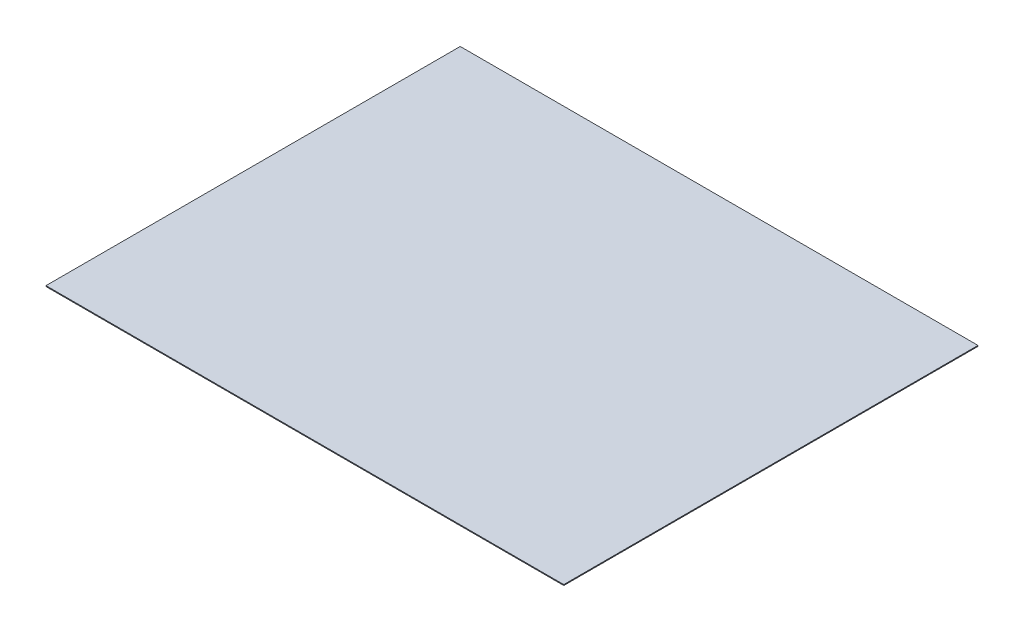
ISO-10303-21;
HEADER;
FILE_DESCRIPTION(('STEP AP214'),'2;1');
FILE_NAME('part.step','',(''),(''),'','','');
FILE_SCHEMA(('AUTOMOTIVE_DESIGN { 1 0 10303 214 1 1 1 1 }'));
ENDSEC;
DATA;
#1=APPLICATION_CONTEXT('core data for automotive mechanical design processes');
#2=APPLICATION_PROTOCOL_DEFINITION('international standard','automotive_design',2000,#1);
#3=PRODUCT_CONTEXT('',#1,'mechanical');
#4=PRODUCT('Part','Part','',(#3));
#5=PRODUCT_RELATED_PRODUCT_CATEGORY('part','',(#4));
#6=PRODUCT_DEFINITION_FORMATION('','',#4);
#7=PRODUCT_DEFINITION_CONTEXT('part definition',#1,'design');
#8=PRODUCT_DEFINITION('design','',#6,#7);
#9=PRODUCT_DEFINITION_SHAPE('','',#8);
#10=(LENGTH_UNIT() NAMED_UNIT(*) SI_UNIT(.MILLI.,.METRE.));
#11=(NAMED_UNIT(*) PLANE_ANGLE_UNIT() SI_UNIT($,.RADIAN.));
#12=(NAMED_UNIT(*) SI_UNIT($,.STERADIAN.) SOLID_ANGLE_UNIT());
#13=UNCERTAINTY_MEASURE_WITH_UNIT(LENGTH_MEASURE(1.E-05),#10,'distance_accuracy_value','');
#14=(GEOMETRIC_REPRESENTATION_CONTEXT(3) GLOBAL_UNCERTAINTY_ASSIGNED_CONTEXT((#13)) GLOBAL_UNIT_ASSIGNED_CONTEXT((#10,
#11,#12)) REPRESENTATION_CONTEXT('',''));
#15=CARTESIAN_POINT('',(0.,0.,0.));
#16=DIRECTION('',(0.,0.,1.));
#17=DIRECTION('',(1.,0.,0.));
#18=AXIS2_PLACEMENT_3D('',#15,#16,#17);
#19=CARTESIAN_POINT('',(-593.124324324324,2.54,-197.708108108108));
#20=DIRECTION('',(1.,0.,0.));
#21=DIRECTION('',(0.,0.,-1.));
#22=AXIS2_PLACEMENT_3D('',#19,#20,#21);
#23=PLANE('',#22);
#24=DIRECTION('',(0.,0.,1.));
#25=VECTOR('',#24,1.);
#26=CARTESIAN_POINT('',(-593.124324324324,0.,-197.708108108108));
#27=LINE('',#26,#25);
#28=CARTESIAN_POINT('',(-593.124324324324,0.,-197.708108108108));
#29=VERTEX_POINT('',#28);
#30=CARTESIAN_POINT('',(-593.124324324324,0.,1021.49189189189));
#31=VERTEX_POINT('',#30);
#32=EDGE_CURVE('E107',#29,#31,#27,.T.);
#33=ORIENTED_EDGE('',*,*,#32,.T.);
#34=DIRECTION('',(0.,-1.,0.));
#35=VECTOR('',#34,1.);
#36=CARTESIAN_POINT('',(-593.124324324324,2.54,1021.49189189189));
#37=LINE('',#36,#35);
#38=CARTESIAN_POINT('',(-593.124324324324,2.54,1021.49189189189));
#39=VERTEX_POINT('',#38);
#40=EDGE_CURVE('E11',#39,#31,#37,.T.);
#41=ORIENTED_EDGE('',*,*,#40,.F.);
#42=DIRECTION('',(0.,0.,1.));
#43=VECTOR('',#42,1.);
#44=CARTESIAN_POINT('',(-593.124324324324,2.54,-197.708108108108));
#45=LINE('',#44,#43);
#46=CARTESIAN_POINT('',(-593.124324324324,2.54,-197.708108108108));
#47=VERTEX_POINT('',#46);
#48=EDGE_CURVE('E91',#47,#39,#45,.T.);
#49=ORIENTED_EDGE('',*,*,#48,.F.);
#50=DIRECTION('',(0.,-1.,0.));
#51=VECTOR('',#50,1.);
#52=CARTESIAN_POINT('',(-593.124324324324,2.54,-197.708108108108));
#53=LINE('',#52,#51);
#54=EDGE_CURVE('E103',#47,#29,#53,.T.);
#55=ORIENTED_EDGE('',*,*,#54,.T.);
#56=EDGE_LOOP('',(#33,#41,#49,#55));
#57=FACE_BOUND('',#56,.T.);
#58=ADVANCED_FACE('F39',(#57),#23,.F.);
#59=CARTESIAN_POINT('',(-593.124324324324,2.54,1021.49189189189));
#60=DIRECTION('',(0.,0.,-1.));
#61=DIRECTION('',(-1.,0.,0.));
#62=AXIS2_PLACEMENT_3D('',#59,#60,#61);
#63=PLANE('',#62);
#64=DIRECTION('',(1.,0.,0.));
#65=VECTOR('',#64,1.);
#66=CARTESIAN_POINT('',(-593.124324324324,0.,1021.49189189189));
#67=LINE('',#66,#65);
#68=CARTESIAN_POINT('',(930.875675675676,0.,1021.49189189189));
#69=VERTEX_POINT('',#68);
#70=EDGE_CURVE('E96',#31,#69,#67,.T.);
#71=ORIENTED_EDGE('',*,*,#70,.T.);
#72=DIRECTION('',(0.,-1.,0.));
#73=VECTOR('',#72,1.);
#74=CARTESIAN_POINT('',(930.875675675676,2.54,1021.49189189189));
#75=LINE('',#74,#73);
#76=CARTESIAN_POINT('',(930.875675675676,2.54,1021.49189189189));
#77=VERTEX_POINT('',#76);
#78=EDGE_CURVE('E48',#77,#69,#75,.T.);
#79=ORIENTED_EDGE('',*,*,#78,.F.);
#80=DIRECTION('',(1.,0.,0.));
#81=VECTOR('',#80,1.);
#82=CARTESIAN_POINT('',(-593.124324324324,2.54,1021.49189189189));
#83=LINE('',#82,#81);
#84=EDGE_CURVE('E86',#39,#77,#83,.T.);
#85=ORIENTED_EDGE('',*,*,#84,.F.);
#86=ORIENTED_EDGE('',*,*,#40,.T.);
#87=EDGE_LOOP('',(#71,#79,#85,#86));
#88=FACE_BOUND('',#87,.T.);
#89=ADVANCED_FACE('F95',(#88),#63,.F.);
#90=CARTESIAN_POINT('',(930.875675675676,2.54,-197.708108108108));
#91=DIRECTION('',(-1.,0.,0.));
#92=DIRECTION('',(0.,0.,1.));
#93=AXIS2_PLACEMENT_3D('',#90,#91,#92);
#94=PLANE('',#93);
#95=DIRECTION('',(0.,0.,-1.));
#96=VECTOR('',#95,1.);
#97=CARTESIAN_POINT('',(930.875675675676,0.,-197.708108108108));
#98=LINE('',#97,#96);
#99=CARTESIAN_POINT('',(930.875675675676,0.,-197.708108108108));
#100=VERTEX_POINT('',#99);
#101=EDGE_CURVE('E73',#69,#100,#98,.T.);
#102=ORIENTED_EDGE('',*,*,#101,.T.);
#103=DIRECTION('',(0.,-1.,0.));
#104=VECTOR('',#103,1.);
#105=CARTESIAN_POINT('',(930.875675675676,2.54,-197.708108108108));
#106=LINE('',#105,#104);
#107=CARTESIAN_POINT('',(930.875675675676,2.54,-197.708108108108));
#108=VERTEX_POINT('',#107);
#109=EDGE_CURVE('E98',#108,#100,#106,.T.);
#110=ORIENTED_EDGE('',*,*,#109,.F.);
#111=DIRECTION('',(0.,0.,-1.));
#112=VECTOR('',#111,1.);
#113=CARTESIAN_POINT('',(930.875675675676,2.54,-197.708108108108));
#114=LINE('',#113,#112);
#115=EDGE_CURVE('E89',#77,#108,#114,.T.);
#116=ORIENTED_EDGE('',*,*,#115,.F.);
#117=ORIENTED_EDGE('',*,*,#78,.T.);
#118=EDGE_LOOP('',(#102,#110,#116,#117));
#119=FACE_BOUND('',#118,.T.);
#120=ADVANCED_FACE('F99',(#119),#94,.F.);
#121=CARTESIAN_POINT('',(-593.124324324324,2.54,-197.708108108108));
#122=DIRECTION('',(0.,0.,1.));
#123=DIRECTION('',(1.,0.,0.));
#124=AXIS2_PLACEMENT_3D('',#121,#122,#123);
#125=PLANE('',#124);
#126=DIRECTION('',(-1.,0.,0.));
#127=VECTOR('',#126,1.);
#128=CARTESIAN_POINT('',(-593.124324324324,0.,-197.708108108108));
#129=LINE('',#128,#127);
#130=EDGE_CURVE('E79',#100,#29,#129,.T.);
#131=ORIENTED_EDGE('',*,*,#130,.T.);
#132=ORIENTED_EDGE('',*,*,#54,.F.);
#133=DIRECTION('',(-1.,0.,0.));
#134=VECTOR('',#133,1.);
#135=CARTESIAN_POINT('',(-593.124324324324,2.54,-197.708108108108));
#136=LINE('',#135,#134);
#137=EDGE_CURVE('E56',#108,#47,#136,.T.);
#138=ORIENTED_EDGE('',*,*,#137,.F.);
#139=ORIENTED_EDGE('',*,*,#109,.T.);
#140=EDGE_LOOP('',(#131,#132,#138,#139));
#141=FACE_BOUND('',#140,.T.);
#142=ADVANCED_FACE('F120',(#141),#125,.F.);
#143=CARTESIAN_POINT('',(0.,2.54,0.));
#144=DIRECTION('',(0.,1.,0.));
#145=DIRECTION('',(0.,0.,1.));
#146=AXIS2_PLACEMENT_3D('',#143,#144,#145);
#147=PLANE('',#146);
#148=ORIENTED_EDGE('',*,*,#48,.T.);
#149=ORIENTED_EDGE('',*,*,#84,.T.);
#150=ORIENTED_EDGE('',*,*,#115,.T.);
#151=ORIENTED_EDGE('',*,*,#137,.T.);
#152=EDGE_LOOP('',(#148,#149,#150,#151));
#153=FACE_BOUND('',#152,.T.);
#154=ADVANCED_FACE('F87',(#153),#147,.T.);
#155=CARTESIAN_POINT('',(0.,0.,0.));
#156=DIRECTION('',(0.,1.,0.));
#157=DIRECTION('',(0.,0.,1.));
#158=AXIS2_PLACEMENT_3D('',#155,#156,#157);
#159=PLANE('',#158);
#160=ORIENTED_EDGE('',*,*,#32,.F.);
#161=ORIENTED_EDGE('',*,*,#130,.F.);
#162=ORIENTED_EDGE('',*,*,#101,.F.);
#163=ORIENTED_EDGE('',*,*,#70,.F.);
#164=EDGE_LOOP('',(#160,#161,#162,#163));
#165=FACE_BOUND('',#164,.T.);
#166=ADVANCED_FACE('F123',(#165),#159,.F.);
#167=CLOSED_SHELL('',(#58,#89,#120,#142,#154,#166));
#168=MANIFOLD_SOLID_BREP('B2',#167);
#169=ADVANCED_BREP_SHAPE_REPRESENTATION('',(#18,#168),#14);
#170=SHAPE_DEFINITION_REPRESENTATION(#9,#169);
ENDSEC;
END-ISO-10303-21;
